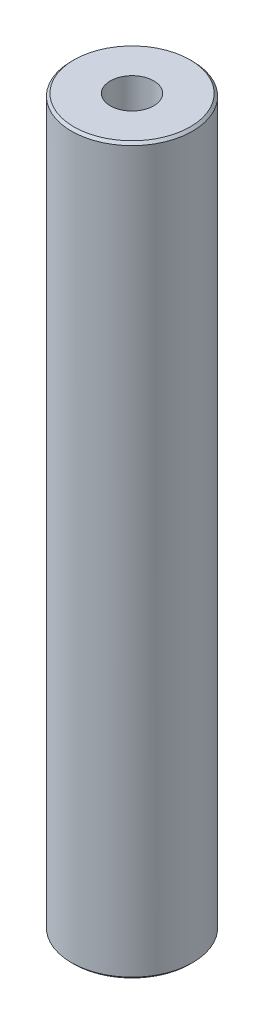
ISO-10303-21;
HEADER;
FILE_DESCRIPTION(('STEP AP214'),'2;1');
FILE_NAME('part.step','',(''),(''),'','','');
FILE_SCHEMA(('AUTOMOTIVE_DESIGN { 1 0 10303 214 1 1 1 1 }'));
ENDSEC;
DATA;
#1=APPLICATION_CONTEXT('core data for automotive mechanical design processes');
#2=APPLICATION_PROTOCOL_DEFINITION('international standard','automotive_design',2000,#1);
#3=PRODUCT_CONTEXT('',#1,'mechanical');
#4=PRODUCT('Part','Part','',(#3));
#5=PRODUCT_RELATED_PRODUCT_CATEGORY('part','',(#4));
#6=PRODUCT_DEFINITION_FORMATION('','',#4);
#7=PRODUCT_DEFINITION_CONTEXT('part definition',#1,'design');
#8=PRODUCT_DEFINITION('design','',#6,#7);
#9=PRODUCT_DEFINITION_SHAPE('','',#8);
#10=(LENGTH_UNIT() NAMED_UNIT(*) SI_UNIT(.MILLI.,.METRE.));
#11=(NAMED_UNIT(*) PLANE_ANGLE_UNIT() SI_UNIT($,.RADIAN.));
#12=(NAMED_UNIT(*) SI_UNIT($,.STERADIAN.) SOLID_ANGLE_UNIT());
#13=UNCERTAINTY_MEASURE_WITH_UNIT(LENGTH_MEASURE(1.E-05),#10,'distance_accuracy_value','');
#14=(GEOMETRIC_REPRESENTATION_CONTEXT(3) GLOBAL_UNCERTAINTY_ASSIGNED_CONTEXT((#13)) GLOBAL_UNIT_ASSIGNED_CONTEXT((#10,
#11,#12)) REPRESENTATION_CONTEXT('',''));
#15=CARTESIAN_POINT('',(0.,0.,0.));
#16=DIRECTION('',(0.,0.,1.));
#17=DIRECTION('',(1.,0.,0.));
#18=AXIS2_PLACEMENT_3D('',#15,#16,#17);
#19=CARTESIAN_POINT('',(0.,119.69772419561,0.));
#20=DIRECTION('',(0.,-1.,0.));
#21=DIRECTION('',(0.,0.,-1.));
#22=AXIS2_PLACEMENT_3D('',#19,#20,#21);
#23=CYLINDRICAL_SURFACE('',#22,10.);
#24=CARTESIAN_POINT('',(0.,119.290252703079,0.));
#25=DIRECTION('',(0.,1.,0.));
#26=DIRECTION('',(0.,0.,1.));
#27=AXIS2_PLACEMENT_3D('',#24,#25,#26);
#28=CIRCLE('',#27,10.);
#29=CARTESIAN_POINT('',(0.,119.290252703079,-10.));
#30=VERTEX_POINT('',#29);
#31=EDGE_CURVE('E50',#30,#30,#28,.F.);
#32=CARTESIAN_POINT('',(0.,0.407471492530551,0.));
#33=DIRECTION('',(0.,1.,0.));
#34=DIRECTION('',(0.,0.,1.));
#35=AXIS2_PLACEMENT_3D('',#32,#33,#34);
#36=CIRCLE('',#35,10.);
#37=CARTESIAN_POINT('',(0.,0.407471492530551,-10.));
#38=VERTEX_POINT('',#37);
#39=EDGE_CURVE('E51',#38,#38,#36,.T.);
#40=CARTESIAN_POINT('',(0.,119.290252703079,-10.));
#41=CARTESIAN_POINT('',(0.,118.051890398803,-10.));
#42=CARTESIAN_POINT('',(0.,116.813528094526,-10.));
#43=CARTESIAN_POINT('',(0.,114.336803485973,-10.));
#44=CARTESIAN_POINT('',(0.,113.098441181697,-10.));
#45=CARTESIAN_POINT('',(0.,110.621716573143,-10.));
#46=CARTESIAN_POINT('',(0.,109.383354268867,-10.));
#47=CARTESIAN_POINT('',(0.,106.906629660314,-10.));
#48=CARTESIAN_POINT('',(0.,105.668267356037,-10.));
#49=CARTESIAN_POINT('',(0.,103.191542747484,-10.));
#50=CARTESIAN_POINT('',(0.,101.953180443208,-10.));
#51=CARTESIAN_POINT('',(0.,99.4764558346545,-10.));
#52=CARTESIAN_POINT('',(0.,98.2380935303779,-10.));
#53=CARTESIAN_POINT('',(0.,95.7613689218248,-10.));
#54=CARTESIAN_POINT('',(0.,94.5230066175483,-10.));
#55=CARTESIAN_POINT('',(0.,92.0462820089952,-10.));
#56=CARTESIAN_POINT('',(0.,90.8079197047186,-10.));
#57=CARTESIAN_POINT('',(0.,88.3311950961655,-10.));
#58=CARTESIAN_POINT('',(0.,87.092832791889,-10.));
#59=CARTESIAN_POINT('',(0.,84.6161081833359,-10.));
#60=CARTESIAN_POINT('',(0.,83.3777458790593,-10.));
#61=CARTESIAN_POINT('',(0.,80.9010212705062,-10.));
#62=CARTESIAN_POINT('',(0.,79.6626589662297,-10.));
#63=CARTESIAN_POINT('',(0.,77.1859343576766,-10.));
#64=CARTESIAN_POINT('',(0.,75.9475720534001,-10.));
#65=CARTESIAN_POINT('',(0.,73.470847444847,-10.));
#66=CARTESIAN_POINT('',(0.,72.2324851405704,-10.));
#67=CARTESIAN_POINT('',(0.,69.7557605320173,-10.));
#68=CARTESIAN_POINT('',(0.,68.5173982277408,-10.));
#69=CARTESIAN_POINT('',(0.,66.0406736191877,-10.));
#70=CARTESIAN_POINT('',(0.,64.8023113149111,-10.));
#71=CARTESIAN_POINT('',(0.,62.325586706358,-10.));
#72=CARTESIAN_POINT('',(0.,61.0872244020815,-10.));
#73=CARTESIAN_POINT('',(0.,58.6104997935284,-10.));
#74=CARTESIAN_POINT('',(0.,57.3721374892518,-10.));
#75=CARTESIAN_POINT('',(0.,54.8954128806987,-10.));
#76=CARTESIAN_POINT('',(0.,53.6570505764222,-10.));
#77=CARTESIAN_POINT('',(0.,51.1803259678691,-10.));
#78=CARTESIAN_POINT('',(0.,49.9419636635925,-10.));
#79=CARTESIAN_POINT('',(0.,47.4652390550394,-10.));
#80=CARTESIAN_POINT('',(0.,46.2268767507629,-10.));
#81=CARTESIAN_POINT('',(0.,43.7501521422098,-10.));
#82=CARTESIAN_POINT('',(0.,42.5117898379332,-10.));
#83=CARTESIAN_POINT('',(0.,40.0350652293801,-10.));
#84=CARTESIAN_POINT('',(0.,38.7967029251036,-10.));
#85=CARTESIAN_POINT('',(0.,36.3199783165505,-10.));
#86=CARTESIAN_POINT('',(0.,35.0816160122739,-10.));
#87=CARTESIAN_POINT('',(0.,32.6048914037208,-10.));
#88=CARTESIAN_POINT('',(0.,31.3665290994443,-10.));
#89=CARTESIAN_POINT('',(0.,28.8898044908912,-10.));
#90=CARTESIAN_POINT('',(0.,27.6514421866146,-10.));
#91=CARTESIAN_POINT('',(0.,25.1747175780615,-10.));
#92=CARTESIAN_POINT('',(0.,23.936355273785,-10.));
#93=CARTESIAN_POINT('',(0.,21.4596306652319,-10.));
#94=CARTESIAN_POINT('',(0.,20.2212683609553,-10.));
#95=CARTESIAN_POINT('',(0.,17.7445437524022,-10.));
#96=CARTESIAN_POINT('',(0.,16.5061814481257,-10.));
#97=CARTESIAN_POINT('',(0.,14.0294568395726,-10.));
#98=CARTESIAN_POINT('',(0.,12.791094535296,-10.));
#99=CARTESIAN_POINT('',(0.,10.3143699267429,-10.));
#100=CARTESIAN_POINT('',(0.,9.07600762246639,-10.));
#101=CARTESIAN_POINT('',(0.,6.59928301391329,-10.));
#102=CARTESIAN_POINT('',(0.,5.36092070963675,-10.));
#103=CARTESIAN_POINT('',(0.,2.88419610108365,-10.));
#104=CARTESIAN_POINT('',(0.,1.6458337968071,-10.));
#105=CARTESIAN_POINT('',(0.,0.407471492530551,-10.));
#106=B_SPLINE_CURVE_WITH_KNOTS('',3,(#40,#41,#42,#43,#44,#45,#46,#47,#48,#49,#50,#51,#52,#53,
#54,#55,#56,#57,#58,#59,#60,#61,#62,#63,#64,#65,#66,#67,#68,#69,#70,#71,#72,#73,#74,#75,#76,#77,
#78,#79,#80,#81,#82,#83,#84,#85,#86,#87,#88,#89,#90,#91,#92,#93,#94,#95,#96,#97,#98,#99,#100,
#101,#102,#103,#104,#105),.UNSPECIFIED.,.F.,.F.,(4,2,2,2,2,2,2,2,2,2,2,2,2,2,2,2,2,2,2,2,2,2,2,
2,2,2,2,2,2,2,2,2,4),(0.,3.71508691282964,7.43017382565929,11.1452607384889,14.8603476513186,
18.5754345641482,22.2905214769779,26.0056083898075,29.7206953026372,33.4357822154668,
37.1508691282965,40.8659560411261,44.5810429539558,48.2961298667854,52.0112167796151,
55.7263036924447,59.4413906052743,63.156477518104,66.8715644309336,70.5866513437633,
74.3017382565929,78.0168251694226,81.7319120822522,85.4469989950819,89.1620859079115,
92.8771728207412,96.5922597335708,100.3073466464,104.02243355923,107.73752047206,
111.452607384889,115.167694297719,118.882781210549),.UNSPECIFIED.);
#107=EDGE_CURVE('BSEAM39',#30,#38,#106,.T.);
#108=ORIENTED_EDGE('',*,*,#31,.T.);
#109=ORIENTED_EDGE('',*,*,#39,.T.);
#110=ORIENTED_EDGE('',*,*,#107,.T.);
#111=ORIENTED_EDGE('',*,*,#107,.F.);
#112=EDGE_LOOP('',(#108,#110,#109,#111));
#113=FACE_BOUND('',#112,.T.);
#114=ADVANCED_FACE('F39',(#113),#23,.T.);
#115=CARTESIAN_POINT('',(0.,119.69772419561,0.));
#116=DIRECTION('',(0.,1.,0.));
#117=DIRECTION('',(0.,0.,1.));
#118=AXIS2_PLACEMENT_3D('',#115,#116,#117);
#119=PLANE('',#118);
#120=CARTESIAN_POINT('',(0.,119.69772419561,0.));
#121=DIRECTION('',(0.,1.,0.));
#122=DIRECTION('',(0.,0.,1.));
#123=AXIS2_PLACEMENT_3D('',#120,#121,#122);
#124=CIRCLE('',#123,9.59252850746958);
#125=CARTESIAN_POINT('',(0.,119.69772419561,9.59252850746958));
#126=VERTEX_POINT('',#125);
#127=EDGE_CURVE('E54',#126,#126,#124,.T.);
#128=ORIENTED_EDGE('',*,*,#127,.T.);
#129=EDGE_LOOP('',(#128));
#130=FACE_BOUND('',#129,.T.);
#131=CARTESIAN_POINT('',(0.,119.69772419561,0.));
#132=DIRECTION('',(0.,1.,0.));
#133=DIRECTION('',(0.,0.,1.));
#134=AXIS2_PLACEMENT_3D('',#131,#132,#133);
#135=CIRCLE('',#134,3.58155569201422);
#136=CARTESIAN_POINT('',(0.,119.69772419561,-3.58155569201422));
#137=VERTEX_POINT('',#136);
#138=EDGE_CURVE('E58',#137,#137,#135,.T.);
#139=ORIENTED_EDGE('',*,*,#138,.F.);
#140=EDGE_LOOP('',(#139));
#141=FACE_BOUND('',#140,.T.);
#142=ADVANCED_FACE('F69',(#130,#141),#119,.T.);
#143=CARTESIAN_POINT('',(0.,0.,0.));
#144=DIRECTION('',(0.,1.,0.));
#145=DIRECTION('',(0.,0.,1.));
#146=AXIS2_PLACEMENT_3D('',#143,#144,#145);
#147=PLANE('',#146);
#148=CARTESIAN_POINT('',(0.,0.,0.));
#149=DIRECTION('',(0.,1.,0.));
#150=DIRECTION('',(0.,0.,1.));
#151=AXIS2_PLACEMENT_3D('',#148,#149,#150);
#152=CIRCLE('',#151,9.59252850746943);
#153=CARTESIAN_POINT('',(0.,0.,9.59252850746943));
#154=VERTEX_POINT('',#153);
#155=EDGE_CURVE('E10',#154,#154,#152,.F.);
#156=ORIENTED_EDGE('',*,*,#155,.T.);
#157=EDGE_LOOP('',(#156));
#158=FACE_BOUND('',#157,.T.);
#159=CARTESIAN_POINT('',(0.,0.,0.));
#160=DIRECTION('',(0.,1.,0.));
#161=DIRECTION('',(0.,0.,1.));
#162=AXIS2_PLACEMENT_3D('',#159,#160,#161);
#163=CIRCLE('',#162,3.58155569201422);
#164=CARTESIAN_POINT('',(0.,0.,-3.58155569201422));
#165=VERTEX_POINT('',#164);
#166=EDGE_CURVE('E63',#165,#165,#163,.T.);
#167=ORIENTED_EDGE('',*,*,#166,.T.);
#168=EDGE_LOOP('',(#167));
#169=FACE_BOUND('',#168,.T.);
#170=ADVANCED_FACE('F75',(#158,#169),#147,.F.);
#171=CARTESIAN_POINT('',(0.,119.69772419561,0.));
#172=DIRECTION('',(0.,-1.,0.));
#173=DIRECTION('',(0.,0.,-1.));
#174=AXIS2_PLACEMENT_3D('',#171,#172,#173);
#175=CYLINDRICAL_SURFACE('',#174,3.58155569201422);
#176=CARTESIAN_POINT('',(0.,119.69772419561,-3.58155569201422));
#177=CARTESIAN_POINT('',(0.,118.450872901905,-3.58155569201422));
#178=CARTESIAN_POINT('',(0.,117.204021608201,-3.58155569201422));
#179=CARTESIAN_POINT('',(0.,114.710319020793,-3.58155569201422));
#180=CARTESIAN_POINT('',(0.,113.463467727088,-3.58155569201422));
#181=CARTESIAN_POINT('',(0.,110.96976513968,-3.58155569201422));
#182=CARTESIAN_POINT('',(0.,109.722913845976,-3.58155569201422));
#183=CARTESIAN_POINT('',(0.,107.229211258567,-3.58155569201422));
#184=CARTESIAN_POINT('',(0.,105.982359964863,-3.58155569201422));
#185=CARTESIAN_POINT('',(0.,103.488657377454,-3.58155569201422));
#186=CARTESIAN_POINT('',(0.,102.24180608375,-3.58155569201422));
#187=CARTESIAN_POINT('',(0.,99.7481034963414,-3.58155569201422));
#188=CARTESIAN_POINT('',(0.,98.5012522026371,-3.58155569201422));
#189=CARTESIAN_POINT('',(0.,96.0075496152286,-3.58155569201422));
#190=CARTESIAN_POINT('',(0.,94.7606983215243,-3.58155569201422));
#191=CARTESIAN_POINT('',(0.,92.2669957341158,-3.58155569201422));
#192=CARTESIAN_POINT('',(0.,91.0201444404115,-3.58155569201422));
#193=CARTESIAN_POINT('',(0.,88.526441853003,-3.58155569201422));
#194=CARTESIAN_POINT('',(0.,87.2795905592987,-3.58155569201422));
#195=CARTESIAN_POINT('',(0.,84.7858879718902,-3.58155569201422));
#196=CARTESIAN_POINT('',(0.,83.5390366781859,-3.58155569201422));
#197=CARTESIAN_POINT('',(0.,81.0453340907774,-3.58155569201422));
#198=CARTESIAN_POINT('',(0.,79.7984827970731,-3.58155569201422));
#199=CARTESIAN_POINT('',(0.,77.3047802096646,-3.58155569201422));
#200=CARTESIAN_POINT('',(0.,76.0579289159603,-3.58155569201422));
#201=CARTESIAN_POINT('',(0.,73.5642263285518,-3.58155569201422));
#202=CARTESIAN_POINT('',(0.,72.3173750348475,-3.58155569201422));
#203=CARTESIAN_POINT('',(0.,69.823672447439,-3.58155569201422));
#204=CARTESIAN_POINT('',(0.,68.5768211537347,-3.58155569201422));
#205=CARTESIAN_POINT('',(0.,66.0831185663262,-3.58155569201422));
#206=CARTESIAN_POINT('',(0.,64.8362672726219,-3.58155569201422));
#207=CARTESIAN_POINT('',(0.,62.3425646852134,-3.58155569201422));
#208=CARTESIAN_POINT('',(0.,61.0957133915091,-3.58155569201422));
#209=CARTESIAN_POINT('',(0.,58.6020108041006,-3.58155569201422));
#210=CARTESIAN_POINT('',(0.,57.3551595103963,-3.58155569201422));
#211=CARTESIAN_POINT('',(0.,54.8614569229878,-3.58155569201422));
#212=CARTESIAN_POINT('',(0.,53.6146056292835,-3.58155569201422));
#213=CARTESIAN_POINT('',(0.,51.120903041875,-3.58155569201422));
#214=CARTESIAN_POINT('',(0.,49.8740517481707,-3.58155569201422));
#215=CARTESIAN_POINT('',(0.,47.3803491607622,-3.58155569201422));
#216=CARTESIAN_POINT('',(0.,46.1334978670579,-3.58155569201422));
#217=CARTESIAN_POINT('',(0.,43.6397952796494,-3.58155569201422));
#218=CARTESIAN_POINT('',(0.,42.3929439859451,-3.58155569201422));
#219=CARTESIAN_POINT('',(0.,39.8992413985366,-3.58155569201422));
#220=CARTESIAN_POINT('',(0.,38.6523901048323,-3.58155569201422));
#221=CARTESIAN_POINT('',(0.,36.1586875174238,-3.58155569201422));
#222=CARTESIAN_POINT('',(0.,34.9118362237195,-3.58155569201422));
#223=CARTESIAN_POINT('',(0.,32.4181336363109,-3.58155569201422));
#224=CARTESIAN_POINT('',(0.,31.1712823426067,-3.58155569201422));
#225=CARTESIAN_POINT('',(0.,28.6775797551981,-3.58155569201422));
#226=CARTESIAN_POINT('',(0.,27.4307284614939,-3.58155569201422));
#227=CARTESIAN_POINT('',(0.,24.9370258740853,-3.58155569201422));
#228=CARTESIAN_POINT('',(0.,23.6901745803811,-3.58155569201422));
#229=CARTESIAN_POINT('',(0.,21.1964719929725,-3.58155569201422));
#230=CARTESIAN_POINT('',(0.,19.9496206992683,-3.58155569201422));
#231=CARTESIAN_POINT('',(0.,17.4559181118597,-3.58155569201422));
#232=CARTESIAN_POINT('',(0.,16.2090668181555,-3.58155569201422));
#233=CARTESIAN_POINT('',(0.,13.7153642307469,-3.58155569201422));
#234=CARTESIAN_POINT('',(0.,12.4685129370427,-3.58155569201422));
#235=CARTESIAN_POINT('',(0.,9.97481034963412,-3.58155569201422));
#236=CARTESIAN_POINT('',(0.,8.72795905592985,-3.58155569201422));
#237=CARTESIAN_POINT('',(0.,6.23425646852132,-3.58155569201422));
#238=CARTESIAN_POINT('',(0.,4.98740517481705,-3.58155569201422));
#239=CARTESIAN_POINT('',(0.,2.49370258740852,-3.58155569201422));
#240=CARTESIAN_POINT('',(0.,1.24685129370425,-3.58155569201422));
#241=CARTESIAN_POINT('',(0.,0.,-3.58155569201422));
#242=B_SPLINE_CURVE_WITH_KNOTS('',3,(#176,#177,#178,#179,#180,#181,#182,#183,#184,#185,#186,
#187,#188,#189,#190,#191,#192,#193,#194,#195,#196,#197,#198,#199,#200,#201,#202,#203,#204,#205,
#206,#207,#208,#209,#210,#211,#212,#213,#214,#215,#216,#217,#218,#219,#220,#221,#222,#223,#224,
#225,#226,#227,#228,#229,#230,#231,#232,#233,#234,#235,#236,#237,#238,#239,#240,#241),
.UNSPECIFIED.,.F.,.F.,(4,2,2,2,2,2,2,2,2,2,2,2,2,2,2,2,2,2,2,2,2,2,2,2,2,2,2,2,2,2,2,2,4),(0.,
3.7405538811128,7.4811077622256,11.2216616433384,14.9622155244512,18.702769405564,
22.4433232866768,26.1838771677896,29.9244310489024,33.6649849300152,37.405538811128,
41.1460926922408,44.8866465733536,48.6272004544664,52.3677543355792,56.108308216692,
59.8488620978048,63.5894159789176,67.3299698600305,71.0705237411432,74.8110776222561,
78.5516315033689,82.2921853844817,86.0327392655945,89.7732931467073,93.5138470278201,
97.2544009089329,100.994954790046,104.735508671158,108.476062552271,112.216616433384,
115.957170314497,119.69772419561),.UNSPECIFIED.);
#243=EDGE_CURVE('BSEAM70',#137,#165,#242,.T.);
#244=ORIENTED_EDGE('',*,*,#138,.T.);
#245=ORIENTED_EDGE('',*,*,#166,.F.);
#246=ORIENTED_EDGE('',*,*,#243,.T.);
#247=ORIENTED_EDGE('',*,*,#243,.F.);
#248=EDGE_LOOP('',(#244,#246,#245,#247));
#249=FACE_BOUND('',#248,.T.);
#250=ADVANCED_FACE('F70',(#249),#175,.F.);
#251=CARTESIAN_POINT('',(0.,119.69772419561,0.));
#252=DIRECTION('',(0.,-1.,0.));
#253=DIRECTION('',(0.,0.,-1.));
#254=AXIS2_PLACEMENT_3D('',#251,#252,#253);
#255=CONICAL_SURFACE('',#254,9.59252850746958,0.78539816339744);
#256=ORIENTED_EDGE('',*,*,#31,.F.);
#257=EDGE_LOOP('',(#256));
#258=FACE_BOUND('',#257,.T.);
#259=ORIENTED_EDGE('',*,*,#127,.F.);
#260=EDGE_LOOP('',(#259));
#261=FACE_BOUND('',#260,.T.);
#262=ADVANCED_FACE('F81',(#258,#261),#255,.T.);
#263=CARTESIAN_POINT('',(0.,0.407471492530551,0.));
#264=DIRECTION('',(0.,1.,0.));
#265=DIRECTION('',(0.,0.,1.));
#266=AXIS2_PLACEMENT_3D('',#263,#264,#265);
#267=CONICAL_SURFACE('',#266,10.,0.785398163397474);
#268=ORIENTED_EDGE('',*,*,#155,.F.);
#269=EDGE_LOOP('',(#268));
#270=FACE_BOUND('',#269,.T.);
#271=ORIENTED_EDGE('',*,*,#39,.F.);
#272=EDGE_LOOP('',(#271));
#273=FACE_BOUND('',#272,.T.);
#274=ADVANCED_FACE('F45',(#270,#273),#267,.T.);
#275=CLOSED_SHELL('',(#114,#142,#170,#250,#262,#274));
#276=MANIFOLD_SOLID_BREP('B2',#275);
#277=ADVANCED_BREP_SHAPE_REPRESENTATION('',(#18,#276),#14);
#278=SHAPE_DEFINITION_REPRESENTATION(#9,#277);
ENDSEC;
END-ISO-10303-21;
